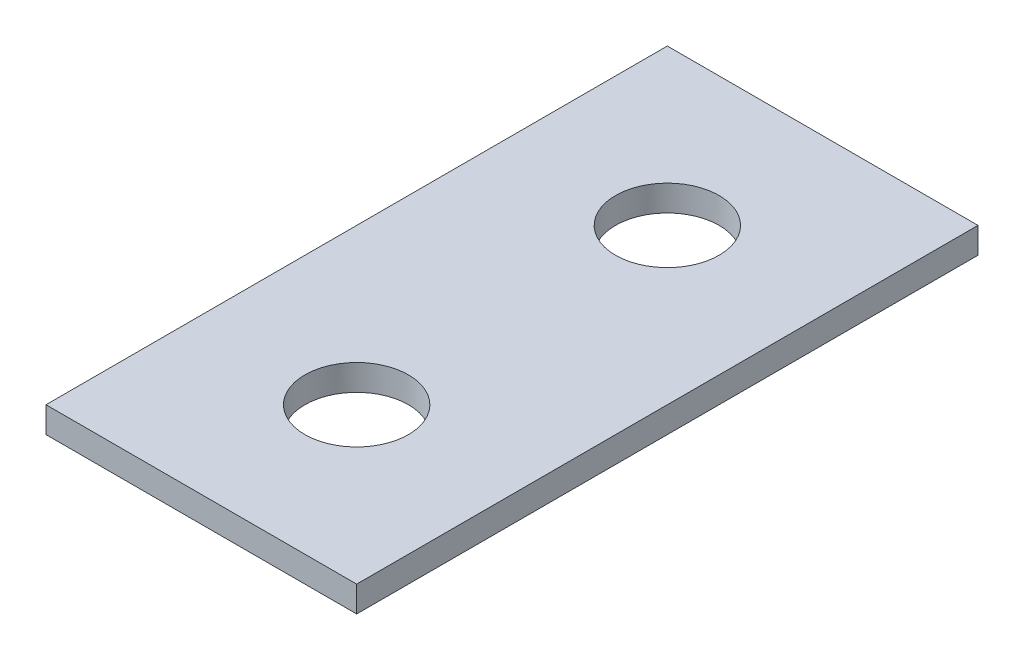
ISO-10303-21;
HEADER;
FILE_DESCRIPTION(('STEP AP214'),'2;1');
FILE_NAME('part.step','',(''),(''),'','','');
FILE_SCHEMA(('AUTOMOTIVE_DESIGN { 1 0 10303 214 1 1 1 1 }'));
ENDSEC;
DATA;
#1=APPLICATION_CONTEXT('core data for automotive mechanical design processes');
#2=APPLICATION_PROTOCOL_DEFINITION('international standard','automotive_design',2000,#1);
#3=PRODUCT_CONTEXT('',#1,'mechanical');
#4=PRODUCT('Part','Part','',(#3));
#5=PRODUCT_RELATED_PRODUCT_CATEGORY('part','',(#4));
#6=PRODUCT_DEFINITION_FORMATION('','',#4);
#7=PRODUCT_DEFINITION_CONTEXT('part definition',#1,'design');
#8=PRODUCT_DEFINITION('design','',#6,#7);
#9=PRODUCT_DEFINITION_SHAPE('','',#8);
#10=(LENGTH_UNIT() NAMED_UNIT(*) SI_UNIT(.MILLI.,.METRE.));
#11=(NAMED_UNIT(*) PLANE_ANGLE_UNIT() SI_UNIT($,.RADIAN.));
#12=(NAMED_UNIT(*) SI_UNIT($,.STERADIAN.) SOLID_ANGLE_UNIT());
#13=UNCERTAINTY_MEASURE_WITH_UNIT(LENGTH_MEASURE(1.E-05),#10,'distance_accuracy_value','');
#14=(GEOMETRIC_REPRESENTATION_CONTEXT(3) GLOBAL_UNCERTAINTY_ASSIGNED_CONTEXT((#13)) GLOBAL_UNIT_ASSIGNED_CONTEXT((#10,
#11,#12)) REPRESENTATION_CONTEXT('',''));
#15=CARTESIAN_POINT('',(0.,0.,0.));
#16=DIRECTION('',(0.,0.,1.));
#17=DIRECTION('',(1.,0.,0.));
#18=AXIS2_PLACEMENT_3D('',#15,#16,#17);
#19=CARTESIAN_POINT('',(0.,6.35,0.));
#20=DIRECTION('',(1.,0.,0.));
#21=DIRECTION('',(0.,0.,-1.));
#22=AXIS2_PLACEMENT_3D('',#19,#20,#21);
#23=PLANE('',#22);
#24=DIRECTION('',(0.,0.,1.));
#25=VECTOR('',#24,1.);
#26=CARTESIAN_POINT('',(0.,0.,0.));
#27=LINE('',#26,#25);
#28=CARTESIAN_POINT('',(0.,0.,-152.4));
#29=VERTEX_POINT('',#28);
#30=CARTESIAN_POINT('',(0.,0.,0.));
#31=VERTEX_POINT('',#30);
#32=EDGE_CURVE('E99',#29,#31,#27,.T.);
#33=ORIENTED_EDGE('',*,*,#32,.T.);
#34=DIRECTION('',(0.,-1.,0.));
#35=VECTOR('',#34,1.);
#36=CARTESIAN_POINT('',(0.,6.35,0.));
#37=LINE('',#36,#35);
#38=CARTESIAN_POINT('',(0.,6.35,0.));
#39=VERTEX_POINT('',#38);
#40=EDGE_CURVE('E11',#39,#31,#37,.T.);
#41=ORIENTED_EDGE('',*,*,#40,.F.);
#42=DIRECTION('',(0.,0.,1.));
#43=VECTOR('',#42,1.);
#44=CARTESIAN_POINT('',(0.,6.35,0.));
#45=LINE('',#44,#43);
#46=CARTESIAN_POINT('',(0.,6.35,-152.4));
#47=VERTEX_POINT('',#46);
#48=EDGE_CURVE('E86',#47,#39,#45,.T.);
#49=ORIENTED_EDGE('',*,*,#48,.F.);
#50=DIRECTION('',(0.,-1.,0.));
#51=VECTOR('',#50,1.);
#52=CARTESIAN_POINT('',(0.,6.35,-152.4));
#53=LINE('',#52,#51);
#54=EDGE_CURVE('E95',#47,#29,#53,.T.);
#55=ORIENTED_EDGE('',*,*,#54,.T.);
#56=EDGE_LOOP('',(#33,#41,#49,#55));
#57=FACE_BOUND('',#56,.T.);
#58=ADVANCED_FACE('F34',(#57),#23,.F.);
#59=CARTESIAN_POINT('',(0.,6.35,0.));
#60=DIRECTION('',(0.,0.,-1.));
#61=DIRECTION('',(-1.,0.,0.));
#62=AXIS2_PLACEMENT_3D('',#59,#60,#61);
#63=PLANE('',#62);
#64=DIRECTION('',(1.,0.,0.));
#65=VECTOR('',#64,1.);
#66=CARTESIAN_POINT('',(0.,0.,0.));
#67=LINE('',#66,#65);
#68=CARTESIAN_POINT('',(76.2,0.,0.));
#69=VERTEX_POINT('',#68);
#70=EDGE_CURVE('E90',#31,#69,#67,.T.);
#71=ORIENTED_EDGE('',*,*,#70,.T.);
#72=DIRECTION('',(0.,-1.,0.));
#73=VECTOR('',#72,1.);
#74=CARTESIAN_POINT('',(76.2,6.35,0.));
#75=LINE('',#74,#73);
#76=CARTESIAN_POINT('',(76.2,6.35,0.));
#77=VERTEX_POINT('',#76);
#78=EDGE_CURVE('E43',#77,#69,#75,.T.);
#79=ORIENTED_EDGE('',*,*,#78,.F.);
#80=DIRECTION('',(1.,0.,0.));
#81=VECTOR('',#80,1.);
#82=CARTESIAN_POINT('',(0.,6.35,0.));
#83=LINE('',#82,#81);
#84=EDGE_CURVE('E81',#39,#77,#83,.T.);
#85=ORIENTED_EDGE('',*,*,#84,.F.);
#86=ORIENTED_EDGE('',*,*,#40,.T.);
#87=EDGE_LOOP('',(#71,#79,#85,#86));
#88=FACE_BOUND('',#87,.T.);
#89=ADVANCED_FACE('F89',(#88),#63,.F.);
#90=CARTESIAN_POINT('',(76.2,6.35,0.));
#91=DIRECTION('',(-1.,0.,0.));
#92=DIRECTION('',(0.,0.,1.));
#93=AXIS2_PLACEMENT_3D('',#90,#91,#92);
#94=PLANE('',#93);
#95=DIRECTION('',(0.,0.,-1.));
#96=VECTOR('',#95,1.);
#97=CARTESIAN_POINT('',(76.2,0.,0.));
#98=LINE('',#97,#96);
#99=CARTESIAN_POINT('',(76.2,0.,-152.4));
#100=VERTEX_POINT('',#99);
#101=EDGE_CURVE('E68',#69,#100,#98,.T.);
#102=ORIENTED_EDGE('',*,*,#101,.T.);
#103=DIRECTION('',(0.,-1.,0.));
#104=VECTOR('',#103,1.);
#105=CARTESIAN_POINT('',(76.2,6.35,-152.4));
#106=LINE('',#105,#104);
#107=CARTESIAN_POINT('',(76.2,6.35,-152.4));
#108=VERTEX_POINT('',#107);
#109=EDGE_CURVE('E91',#108,#100,#106,.T.);
#110=ORIENTED_EDGE('',*,*,#109,.F.);
#111=DIRECTION('',(0.,0.,-1.));
#112=VECTOR('',#111,1.);
#113=CARTESIAN_POINT('',(76.2,6.35,0.));
#114=LINE('',#113,#112);
#115=EDGE_CURVE('E84',#77,#108,#114,.T.);
#116=ORIENTED_EDGE('',*,*,#115,.F.);
#117=ORIENTED_EDGE('',*,*,#78,.T.);
#118=EDGE_LOOP('',(#102,#110,#116,#117));
#119=FACE_BOUND('',#118,.T.);
#120=ADVANCED_FACE('F93',(#119),#94,.F.);
#121=CARTESIAN_POINT('',(0.,6.35,-152.4));
#122=DIRECTION('',(0.,0.,1.));
#123=DIRECTION('',(1.,0.,0.));
#124=AXIS2_PLACEMENT_3D('',#121,#122,#123);
#125=PLANE('',#124);
#126=DIRECTION('',(-1.,0.,0.));
#127=VECTOR('',#126,1.);
#128=CARTESIAN_POINT('',(0.,0.,-152.4));
#129=LINE('',#128,#127);
#130=EDGE_CURVE('E74',#100,#29,#129,.T.);
#131=ORIENTED_EDGE('',*,*,#130,.T.);
#132=ORIENTED_EDGE('',*,*,#54,.F.);
#133=DIRECTION('',(-1.,0.,0.));
#134=VECTOR('',#133,1.);
#135=CARTESIAN_POINT('',(0.,6.35,-152.4));
#136=LINE('',#135,#134);
#137=EDGE_CURVE('E51',#108,#47,#136,.T.);
#138=ORIENTED_EDGE('',*,*,#137,.F.);
#139=ORIENTED_EDGE('',*,*,#109,.T.);
#140=EDGE_LOOP('',(#131,#132,#138,#139));
#141=FACE_BOUND('',#140,.T.);
#142=ADVANCED_FACE('F107',(#141),#125,.F.);
#143=CARTESIAN_POINT('',(0.,6.35,-152.4));
#144=DIRECTION('',(0.,-1.,0.));
#145=DIRECTION('',(0.,0.,-1.));
#146=AXIS2_PLACEMENT_3D('',#143,#144,#145);
#147=PLANE('',#146);
#148=CARTESIAN_POINT('',(38.1,6.35,-38.1));
#149=DIRECTION('',(0.,1.,0.));
#150=DIRECTION('',(0.,0.,1.));
#151=AXIS2_PLACEMENT_3D('',#148,#149,#150);
#152=CIRCLE('',#151,12.7);
#153=CARTESIAN_POINT('',(38.1,6.35,-25.4));
#154=VERTEX_POINT('',#153);
#155=EDGE_CURVE('E118',#154,#154,#152,.T.);
#156=ORIENTED_EDGE('',*,*,#155,.F.);
#157=EDGE_LOOP('',(#156));
#158=FACE_BOUND('',#157,.T.);
#159=CARTESIAN_POINT('',(38.1,6.35,-114.3));
#160=DIRECTION('',(0.,1.,0.));
#161=DIRECTION('',(0.,0.,1.));
#162=AXIS2_PLACEMENT_3D('',#159,#160,#161);
#163=CIRCLE('',#162,12.7);
#164=CARTESIAN_POINT('',(38.1,6.35,-101.6));
#165=VERTEX_POINT('',#164);
#166=EDGE_CURVE('E115',#165,#165,#163,.T.);
#167=ORIENTED_EDGE('',*,*,#166,.F.);
#168=EDGE_LOOP('',(#167));
#169=FACE_BOUND('',#168,.T.);
#170=ORIENTED_EDGE('',*,*,#48,.T.);
#171=ORIENTED_EDGE('',*,*,#84,.T.);
#172=ORIENTED_EDGE('',*,*,#115,.T.);
#173=ORIENTED_EDGE('',*,*,#137,.T.);
#174=EDGE_LOOP('',(#170,#171,#172,#173));
#175=FACE_BOUND('',#174,.T.);
#176=ADVANCED_FACE('F82',(#158,#169,#175),#147,.F.);
#177=CARTESIAN_POINT('',(0.,0.,-152.4));
#178=DIRECTION('',(0.,-1.,0.));
#179=DIRECTION('',(0.,0.,-1.));
#180=AXIS2_PLACEMENT_3D('',#177,#178,#179);
#181=PLANE('',#180);
#182=CARTESIAN_POINT('',(38.1,0.,-38.1));
#183=DIRECTION('',(0.,-1.,0.));
#184=DIRECTION('',(0.,0.,-1.));
#185=AXIS2_PLACEMENT_3D('',#182,#183,#184);
#186=CIRCLE('',#185,12.7);
#187=CARTESIAN_POINT('',(38.1,0.,-50.8));
#188=VERTEX_POINT('',#187);
#189=EDGE_CURVE('E37',#188,#188,#186,.T.);
#190=ORIENTED_EDGE('',*,*,#189,.F.);
#191=EDGE_LOOP('',(#190));
#192=FACE_BOUND('',#191,.T.);
#193=CARTESIAN_POINT('',(38.1,0.,-114.3));
#194=DIRECTION('',(0.,-1.,0.));
#195=DIRECTION('',(0.,0.,-1.));
#196=AXIS2_PLACEMENT_3D('',#193,#194,#195);
#197=CIRCLE('',#196,12.7);
#198=CARTESIAN_POINT('',(38.1,0.,-127.));
#199=VERTEX_POINT('',#198);
#200=EDGE_CURVE('E102',#199,#199,#197,.T.);
#201=ORIENTED_EDGE('',*,*,#200,.F.);
#202=EDGE_LOOP('',(#201));
#203=FACE_BOUND('',#202,.T.);
#204=ORIENTED_EDGE('',*,*,#32,.F.);
#205=ORIENTED_EDGE('',*,*,#130,.F.);
#206=ORIENTED_EDGE('',*,*,#101,.F.);
#207=ORIENTED_EDGE('',*,*,#70,.F.);
#208=EDGE_LOOP('',(#204,#205,#206,#207));
#209=FACE_BOUND('',#208,.T.);
#210=ADVANCED_FACE('F110',(#192,#203,#209),#181,.T.);
#211=CARTESIAN_POINT('',(38.1,6.35,-114.3));
#212=DIRECTION('',(0.,1.,0.));
#213=DIRECTION('',(0.,0.,1.));
#214=AXIS2_PLACEMENT_3D('',#211,#212,#213);
#215=CYLINDRICAL_SURFACE('',#214,12.7);
#216=ORIENTED_EDGE('',*,*,#200,.T.);
#217=EDGE_LOOP('',(#216));
#218=FACE_BOUND('',#217,.T.);
#219=ORIENTED_EDGE('',*,*,#166,.T.);
#220=EDGE_LOOP('',(#219));
#221=FACE_BOUND('',#220,.T.);
#222=ADVANCED_FACE('F129',(#218,#221),#215,.F.);
#223=CARTESIAN_POINT('',(38.1,6.35,-38.1));
#224=DIRECTION('',(0.,1.,0.));
#225=DIRECTION('',(0.,0.,1.));
#226=AXIS2_PLACEMENT_3D('',#223,#224,#225);
#227=CYLINDRICAL_SURFACE('',#226,12.7);
#228=ORIENTED_EDGE('',*,*,#189,.T.);
#229=EDGE_LOOP('',(#228));
#230=FACE_BOUND('',#229,.T.);
#231=ORIENTED_EDGE('',*,*,#155,.T.);
#232=EDGE_LOOP('',(#231));
#233=FACE_BOUND('',#232,.T.);
#234=ADVANCED_FACE('F125',(#230,#233),#227,.F.);
#235=CLOSED_SHELL('',(#58,#89,#120,#142,#176,#210,#222,#234));
#236=MANIFOLD_SOLID_BREP('B2',#235);
#237=ADVANCED_BREP_SHAPE_REPRESENTATION('',(#18,#236),#14);
#238=SHAPE_DEFINITION_REPRESENTATION(#9,#237);
ENDSEC;
END-ISO-10303-21;
